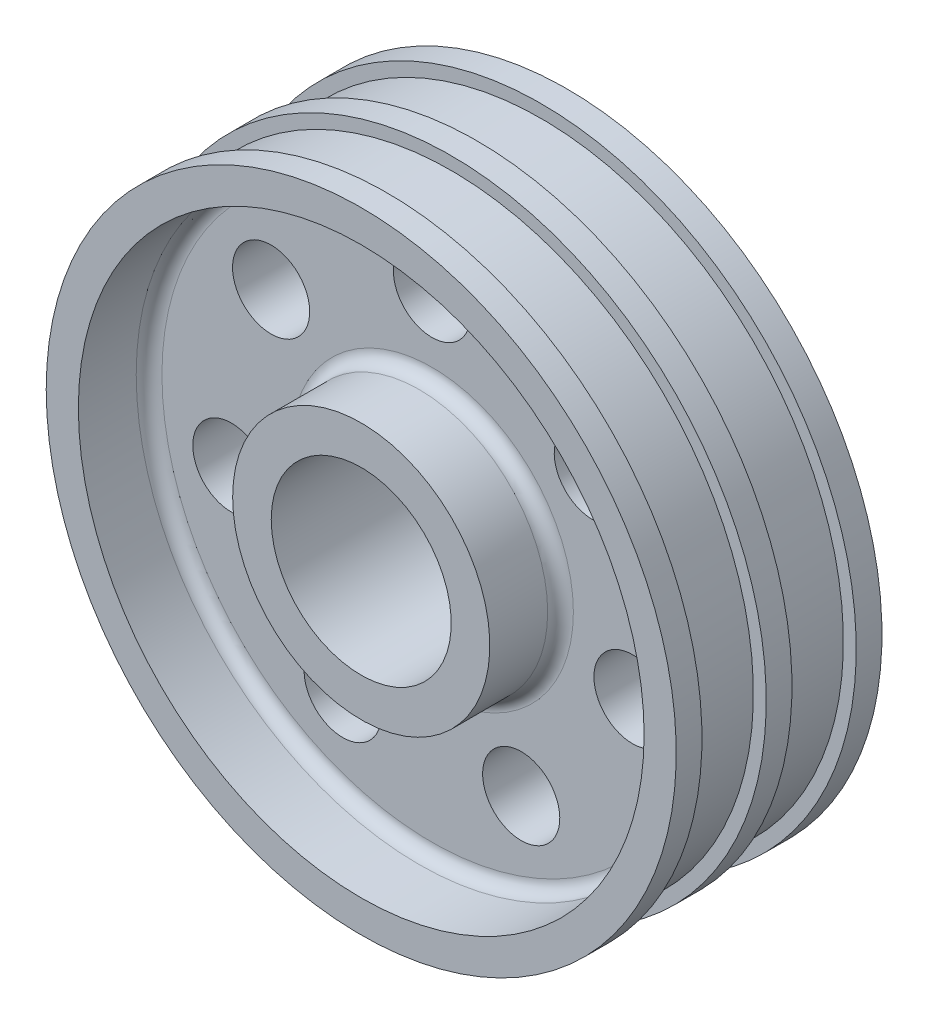
ISO-10303-21;
HEADER;
FILE_DESCRIPTION(('STEP AP214'),'2;1');
FILE_NAME('part.step','',(''),(''),'','','');
FILE_SCHEMA(('AUTOMOTIVE_DESIGN { 1 0 10303 214 1 1 1 1 }'));
ENDSEC;
DATA;
#1=APPLICATION_CONTEXT('core data for automotive mechanical design processes');
#2=APPLICATION_PROTOCOL_DEFINITION('international standard','automotive_design',2000,#1);
#3=PRODUCT_CONTEXT('',#1,'mechanical');
#4=PRODUCT('Part','Part','',(#3));
#5=PRODUCT_RELATED_PRODUCT_CATEGORY('part','',(#4));
#6=PRODUCT_DEFINITION_FORMATION('','',#4);
#7=PRODUCT_DEFINITION_CONTEXT('part definition',#1,'design');
#8=PRODUCT_DEFINITION('design','',#6,#7);
#9=PRODUCT_DEFINITION_SHAPE('','',#8);
#10=(LENGTH_UNIT() NAMED_UNIT(*) SI_UNIT(.MILLI.,.METRE.));
#11=(NAMED_UNIT(*) PLANE_ANGLE_UNIT() SI_UNIT($,.RADIAN.));
#12=(NAMED_UNIT(*) SI_UNIT($,.STERADIAN.) SOLID_ANGLE_UNIT());
#13=UNCERTAINTY_MEASURE_WITH_UNIT(LENGTH_MEASURE(1.E-05),#10,'distance_accuracy_value','');
#14=(GEOMETRIC_REPRESENTATION_CONTEXT(3) GLOBAL_UNCERTAINTY_ASSIGNED_CONTEXT((#13)) GLOBAL_UNIT_ASSIGNED_CONTEXT((#10,
#11,#12)) REPRESENTATION_CONTEXT('',''));
#15=CARTESIAN_POINT('',(0.,0.,0.));
#16=DIRECTION('',(0.,0.,1.));
#17=DIRECTION('',(1.,0.,0.));
#18=AXIS2_PLACEMENT_3D('',#15,#16,#17);
#19=CARTESIAN_POINT('',(0.,49.,16.));
#20=DIRECTION('',(0.,0.,1.));
#21=DIRECTION('',(1.,0.,0.));
#22=AXIS2_PLACEMENT_3D('',#19,#20,#21);
#23=PLANE('',#22);
#24=CARTESIAN_POINT('',(0.,0.,16.));
#25=DIRECTION('',(0.,0.,-1.));
#26=DIRECTION('',(-1.,0.,0.));
#27=AXIS2_PLACEMENT_3D('',#24,#25,#26);
#28=CIRCLE('',#27,44.);
#29=CARTESIAN_POINT('',(-44.,0.,16.));
#30=VERTEX_POINT('',#29);
#31=EDGE_CURVE('E46',#30,#30,#28,.T.);
#32=ORIENTED_EDGE('',*,*,#31,.T.);
#33=EDGE_LOOP('',(#32));
#34=FACE_BOUND('',#33,.T.);
#35=CARTESIAN_POINT('',(0.,0.,16.));
#36=DIRECTION('',(0.,0.,-1.));
#37=DIRECTION('',(-1.,0.,0.));
#38=AXIS2_PLACEMENT_3D('',#35,#36,#37);
#39=CIRCLE('',#38,49.);
#40=CARTESIAN_POINT('',(-49.,0.,16.));
#41=VERTEX_POINT('',#40);
#42=EDGE_CURVE('E75',#41,#41,#39,.T.);
#43=ORIENTED_EDGE('',*,*,#42,.F.);
#44=EDGE_LOOP('',(#43));
#45=FACE_BOUND('',#44,.T.);
#46=ADVANCED_FACE('F14',(#34,#45),#23,.T.);
#47=CARTESIAN_POINT('',(0.,0.,0.));
#48=DIRECTION('',(0.,0.,-1.));
#49=DIRECTION('',(-1.,0.,0.));
#50=AXIS2_PLACEMENT_3D('',#47,#48,#49);
#51=CYLINDRICAL_SURFACE('',#50,44.);
#52=CARTESIAN_POINT('',(0.,0.,7.));
#53=DIRECTION('',(0.,0.,1.));
#54=DIRECTION('',(1.,0.,0.));
#55=AXIS2_PLACEMENT_3D('',#52,#53,#54);
#56=CIRCLE('',#55,44.);
#57=CARTESIAN_POINT('',(44.,0.,7.));
#58=VERTEX_POINT('',#57);
#59=EDGE_CURVE('E9',#58,#58,#56,.F.);
#60=ORIENTED_EDGE('',*,*,#59,.T.);
#61=EDGE_LOOP('',(#60));
#62=FACE_BOUND('',#61,.T.);
#63=ORIENTED_EDGE('',*,*,#31,.F.);
#64=EDGE_LOOP('',(#63));
#65=FACE_BOUND('',#64,.T.);
#66=ADVANCED_FACE('F143',(#62,#65),#51,.F.);
#67=CARTESIAN_POINT('',(0.,44.,5.));
#68=DIRECTION('',(0.,0.,1.));
#69=DIRECTION('',(1.,0.,0.));
#70=AXIS2_PLACEMENT_3D('',#67,#68,#69);
#71=PLANE('',#70);
#72=CARTESIAN_POINT('',(0.,0.,5.));
#73=DIRECTION('',(0.,0.,1.));
#74=DIRECTION('',(1.,0.,0.));
#75=AXIS2_PLACEMENT_3D('',#72,#73,#74);
#76=CIRCLE('',#75,22.);
#77=CARTESIAN_POINT('',(22.,0.,5.));
#78=VERTEX_POINT('',#77);
#79=EDGE_CURVE('E40',#78,#78,#76,.F.);
#80=ORIENTED_EDGE('',*,*,#79,.T.);
#81=EDGE_LOOP('',(#80));
#82=FACE_BOUND('',#81,.T.);
#83=CARTESIAN_POINT('',(0.,0.,5.));
#84=DIRECTION('',(0.,0.,1.));
#85=DIRECTION('',(1.,0.,0.));
#86=AXIS2_PLACEMENT_3D('',#83,#84,#85);
#87=CIRCLE('',#86,42.);
#88=CARTESIAN_POINT('',(42.,0.,5.));
#89=VERTEX_POINT('',#88);
#90=EDGE_CURVE('E43',#89,#89,#87,.T.);
#91=ORIENTED_EDGE('',*,*,#90,.T.);
#92=EDGE_LOOP('',(#91));
#93=FACE_BOUND('',#92,.T.);
#94=CARTESIAN_POINT('',(-25.0186074389767,19.9516736594798,5.));
#95=DIRECTION('',(0.,0.,1.));
#96=DIRECTION('',(0.623489801858743,0.781831482468022,0.));
#97=AXIS2_PLACEMENT_3D('',#94,#95,#96);
#98=CIRCLE('',#97,6.);
#99=CARTESIAN_POINT('',(-21.2776686278242,24.6426625542879,5.));
#100=VERTEX_POINT('',#99);
#101=EDGE_CURVE('E51',#100,#100,#98,.T.);
#102=ORIENTED_EDGE('',*,*,#101,.F.);
#103=EDGE_LOOP('',(#102));
#104=FACE_BOUND('',#103,.T.);
#105=CARTESIAN_POINT('',(-31.1976931898185,-7.12066988660176,5.));
#106=DIRECTION('',(0.,0.,1.));
#107=DIRECTION('',(-0.222520933956305,0.974927912181826,0.));
#108=AXIS2_PLACEMENT_3D('',#105,#106,#107);
#109=CIRCLE('',#108,6.);
#110=CARTESIAN_POINT('',(-32.5328187935563,-1.2711024135108,5.));
#111=VERTEX_POINT('',#110);
#112=EDGE_CURVE('E50',#111,#111,#109,.T.);
#113=ORIENTED_EDGE('',*,*,#112,.F.);
#114=EDGE_LOOP('',(#113));
#115=FACE_BOUND('',#114,.T.);
#116=CARTESIAN_POINT('',(-13.8842796517621,-28.8310037728773,5.));
#117=DIRECTION('',(0.,0.,1.));
#118=DIRECTION('',(-0.900968867902416,0.433883739117565,0.));
#119=AXIS2_PLACEMENT_3D('',#116,#117,#118);
#120=CIRCLE('',#119,6.);
#121=CARTESIAN_POINT('',(-19.2900928591766,-26.2277013381719,5.));
#122=VERTEX_POINT('',#121);
#123=EDGE_CURVE('E55',#122,#122,#120,.T.);
#124=ORIENTED_EDGE('',*,*,#123,.F.);
#125=EDGE_LOOP('',(#124));
#126=FACE_BOUND('',#125,.T.);
#127=CARTESIAN_POINT('',(13.8842796517617,-28.8310037728775,5.));
#128=DIRECTION('',(0.,0.,1.));
#129=DIRECTION('',(-0.900968867902422,-0.433883739117553,0.));
#130=AXIS2_PLACEMENT_3D('',#127,#128,#129);
#131=CIRCLE('',#130,6.);
#132=CARTESIAN_POINT('',(8.47846644434717,-31.4343062075828,5.));
#133=VERTEX_POINT('',#132);
#134=EDGE_CURVE('E59',#133,#133,#131,.T.);
#135=ORIENTED_EDGE('',*,*,#134,.F.);
#136=EDGE_LOOP('',(#135));
#137=FACE_BOUND('',#136,.T.);
#138=CARTESIAN_POINT('',(31.1976931898184,-7.12066988660218,5.));
#139=DIRECTION('',(0.,0.,1.));
#140=DIRECTION('',(-0.222520933956318,-0.974927912181823,0.));
#141=AXIS2_PLACEMENT_3D('',#138,#139,#140);
#142=CIRCLE('',#141,6.);
#143=CARTESIAN_POINT('',(29.8625675860804,-12.9702373596931,5.));
#144=VERTEX_POINT('',#143);
#145=EDGE_CURVE('E63',#144,#144,#142,.T.);
#146=ORIENTED_EDGE('',*,*,#145,.F.);
#147=EDGE_LOOP('',(#146));
#148=FACE_BOUND('',#147,.T.);
#149=CARTESIAN_POINT('',(25.018607438977,19.9516736594795,5.));
#150=DIRECTION('',(0.,0.,1.));
#151=DIRECTION('',(0.623489801858732,-0.781831482468031,0.));
#152=AXIS2_PLACEMENT_3D('',#149,#150,#151);
#153=CIRCLE('',#152,6.);
#154=CARTESIAN_POINT('',(28.7595462501294,15.2606847646713,5.));
#155=VERTEX_POINT('',#154);
#156=EDGE_CURVE('E67',#155,#155,#153,.T.);
#157=ORIENTED_EDGE('',*,*,#156,.F.);
#158=EDGE_LOOP('',(#157));
#159=FACE_BOUND('',#158,.T.);
#160=CARTESIAN_POINT('',(0.,32.,5.));
#161=DIRECTION('',(0.,0.,1.));
#162=DIRECTION('',(1.,0.,0.));
#163=AXIS2_PLACEMENT_3D('',#160,#161,#162);
#164=CIRCLE('',#163,6.);
#165=CARTESIAN_POINT('',(6.,32.,5.));
#166=VERTEX_POINT('',#165);
#167=EDGE_CURVE('E71',#166,#166,#164,.T.);
#168=ORIENTED_EDGE('',*,*,#167,.F.);
#169=EDGE_LOOP('',(#168));
#170=FACE_BOUND('',#169,.T.);
#171=ADVANCED_FACE('F139',(#82,#93,#104,#115,#126,#137,#148,#159,#170),#71,.T.);
#172=CARTESIAN_POINT('',(0.,0.,0.));
#173=DIRECTION('',(0.,0.,-1.));
#174=DIRECTION('',(-1.,0.,0.));
#175=AXIS2_PLACEMENT_3D('',#172,#173,#174);
#176=CYLINDRICAL_SURFACE('',#175,20.);
#177=CARTESIAN_POINT('',(0.,0.,7.));
#178=DIRECTION('',(0.,0.,1.));
#179=DIRECTION('',(1.,0.,0.));
#180=AXIS2_PLACEMENT_3D('',#177,#178,#179);
#181=CIRCLE('',#180,20.);
#182=CARTESIAN_POINT('',(20.,0.,7.));
#183=VERTEX_POINT('',#182);
#184=EDGE_CURVE('E37',#183,#183,#181,.T.);
#185=ORIENTED_EDGE('',*,*,#184,.T.);
#186=EDGE_LOOP('',(#185));
#187=FACE_BOUND('',#186,.T.);
#188=CARTESIAN_POINT('',(0.,0.,16.));
#189=DIRECTION('',(0.,0.,-1.));
#190=DIRECTION('',(-1.,0.,0.));
#191=AXIS2_PLACEMENT_3D('',#188,#189,#190);
#192=CIRCLE('',#191,20.);
#193=CARTESIAN_POINT('',(-20.,0.,16.));
#194=VERTEX_POINT('',#193);
#195=EDGE_CURVE('E78',#194,#194,#192,.T.);
#196=ORIENTED_EDGE('',*,*,#195,.T.);
#197=EDGE_LOOP('',(#196));
#198=FACE_BOUND('',#197,.T.);
#199=ADVANCED_FACE('F142',(#187,#198),#176,.T.);
#200=CARTESIAN_POINT('',(0.,20.,16.));
#201=DIRECTION('',(0.,0.,1.));
#202=DIRECTION('',(1.,0.,0.));
#203=AXIS2_PLACEMENT_3D('',#200,#201,#202);
#204=PLANE('',#203);
#205=CARTESIAN_POINT('',(0.,0.,16.));
#206=DIRECTION('',(0.,0.,-1.));
#207=DIRECTION('',(-1.,0.,0.));
#208=AXIS2_PLACEMENT_3D('',#205,#206,#207);
#209=CIRCLE('',#208,14.);
#210=CARTESIAN_POINT('',(-14.,0.,16.));
#211=VERTEX_POINT('',#210);
#212=EDGE_CURVE('E81',#211,#211,#209,.T.);
#213=ORIENTED_EDGE('',*,*,#212,.T.);
#214=EDGE_LOOP('',(#213));
#215=FACE_BOUND('',#214,.T.);
#216=ORIENTED_EDGE('',*,*,#195,.F.);
#217=EDGE_LOOP('',(#216));
#218=FACE_BOUND('',#217,.T.);
#219=ADVANCED_FACE('F309',(#215,#218),#204,.T.);
#220=CARTESIAN_POINT('',(0.,0.,0.));
#221=DIRECTION('',(0.,0.,-1.));
#222=DIRECTION('',(-1.,0.,0.));
#223=AXIS2_PLACEMENT_3D('',#220,#221,#222);
#224=CYLINDRICAL_SURFACE('',#223,14.);
#225=CARTESIAN_POINT('',(0.,0.,-16.));
#226=DIRECTION('',(0.,0.,-1.));
#227=DIRECTION('',(-1.,0.,0.));
#228=AXIS2_PLACEMENT_3D('',#225,#226,#227);
#229=CIRCLE('',#228,14.);
#230=CARTESIAN_POINT('',(-14.,0.,-16.));
#231=VERTEX_POINT('',#230);
#232=EDGE_CURVE('E84',#231,#231,#229,.T.);
#233=ORIENTED_EDGE('',*,*,#232,.T.);
#234=EDGE_LOOP('',(#233));
#235=FACE_BOUND('',#234,.T.);
#236=ORIENTED_EDGE('',*,*,#212,.F.);
#237=EDGE_LOOP('',(#236));
#238=FACE_BOUND('',#237,.T.);
#239=ADVANCED_FACE('F403',(#235,#238),#224,.F.);
#240=CARTESIAN_POINT('',(0.,20.,-16.));
#241=DIRECTION('',(0.,0.,-1.));
#242=DIRECTION('',(-1.,0.,0.));
#243=AXIS2_PLACEMENT_3D('',#240,#241,#242);
#244=PLANE('',#243);
#245=CARTESIAN_POINT('',(0.,0.,-16.));
#246=DIRECTION('',(0.,0.,-1.));
#247=DIRECTION('',(-1.,0.,0.));
#248=AXIS2_PLACEMENT_3D('',#245,#246,#247);
#249=CIRCLE('',#248,20.);
#250=CARTESIAN_POINT('',(-20.,0.,-16.));
#251=VERTEX_POINT('',#250);
#252=EDGE_CURVE('E87',#251,#251,#249,.T.);
#253=ORIENTED_EDGE('',*,*,#252,.T.);
#254=EDGE_LOOP('',(#253));
#255=FACE_BOUND('',#254,.T.);
#256=ORIENTED_EDGE('',*,*,#232,.F.);
#257=EDGE_LOOP('',(#256));
#258=FACE_BOUND('',#257,.T.);
#259=ADVANCED_FACE('F318',(#255,#258),#244,.T.);
#260=CARTESIAN_POINT('',(0.,0.,0.));
#261=DIRECTION('',(0.,0.,-1.));
#262=DIRECTION('',(-1.,0.,0.));
#263=AXIS2_PLACEMENT_3D('',#260,#261,#262);
#264=CYLINDRICAL_SURFACE('',#263,20.);
#265=CARTESIAN_POINT('',(0.,0.,-7.));
#266=DIRECTION('',(0.,0.,-1.));
#267=DIRECTION('',(-1.,0.,0.));
#268=AXIS2_PLACEMENT_3D('',#265,#266,#267);
#269=CIRCLE('',#268,20.);
#270=CARTESIAN_POINT('',(-20.,0.,-7.));
#271=VERTEX_POINT('',#270);
#272=EDGE_CURVE('E34',#271,#271,#269,.T.);
#273=ORIENTED_EDGE('',*,*,#272,.T.);
#274=EDGE_LOOP('',(#273));
#275=FACE_BOUND('',#274,.T.);
#276=ORIENTED_EDGE('',*,*,#252,.F.);
#277=EDGE_LOOP('',(#276));
#278=FACE_BOUND('',#277,.T.);
#279=ADVANCED_FACE('F208',(#275,#278),#264,.T.);
#280=CARTESIAN_POINT('',(0.,44.,-5.));
#281=DIRECTION('',(0.,0.,-1.));
#282=DIRECTION('',(-1.,0.,0.));
#283=AXIS2_PLACEMENT_3D('',#280,#281,#282);
#284=PLANE('',#283);
#285=CARTESIAN_POINT('',(0.,0.,-5.));
#286=DIRECTION('',(0.,0.,-1.));
#287=DIRECTION('',(-1.,0.,0.));
#288=AXIS2_PLACEMENT_3D('',#285,#286,#287);
#289=CIRCLE('',#288,22.);
#290=CARTESIAN_POINT('',(-22.,0.,-5.));
#291=VERTEX_POINT('',#290);
#292=EDGE_CURVE('E25',#291,#291,#289,.F.);
#293=ORIENTED_EDGE('',*,*,#292,.T.);
#294=EDGE_LOOP('',(#293));
#295=FACE_BOUND('',#294,.T.);
#296=CARTESIAN_POINT('',(0.,0.,-5.));
#297=DIRECTION('',(0.,0.,-1.));
#298=DIRECTION('',(-1.,0.,0.));
#299=AXIS2_PLACEMENT_3D('',#296,#297,#298);
#300=CIRCLE('',#299,42.);
#301=CARTESIAN_POINT('',(-42.,0.,-5.));
#302=VERTEX_POINT('',#301);
#303=EDGE_CURVE('E29',#302,#302,#300,.T.);
#304=ORIENTED_EDGE('',*,*,#303,.T.);
#305=EDGE_LOOP('',(#304));
#306=FACE_BOUND('',#305,.T.);
#307=CARTESIAN_POINT('',(-25.0186074389767,19.9516736594798,-5.));
#308=DIRECTION('',(0.,0.,-1.));
#309=DIRECTION('',(-1.,0.,0.));
#310=AXIS2_PLACEMENT_3D('',#307,#308,#309);
#311=CIRCLE('',#310,6.);
#312=CARTESIAN_POINT('',(-31.0186074389767,19.9516736594798,-5.));
#313=VERTEX_POINT('',#312);
#314=EDGE_CURVE('E47',#313,#313,#311,.T.);
#315=ORIENTED_EDGE('',*,*,#314,.F.);
#316=EDGE_LOOP('',(#315));
#317=FACE_BOUND('',#316,.T.);
#318=CARTESIAN_POINT('',(-31.1976931898185,-7.12066988660176,-5.));
#319=DIRECTION('',(0.,0.,-1.));
#320=DIRECTION('',(-1.,0.,0.));
#321=AXIS2_PLACEMENT_3D('',#318,#319,#320);
#322=CIRCLE('',#321,6.);
#323=CARTESIAN_POINT('',(-37.1976931898185,-7.12066988660176,-5.));
#324=VERTEX_POINT('',#323);
#325=EDGE_CURVE('E52',#324,#324,#322,.T.);
#326=ORIENTED_EDGE('',*,*,#325,.F.);
#327=EDGE_LOOP('',(#326));
#328=FACE_BOUND('',#327,.T.);
#329=CARTESIAN_POINT('',(-13.8842796517621,-28.8310037728773,-5.));
#330=DIRECTION('',(0.,0.,-1.));
#331=DIRECTION('',(-1.,0.,0.));
#332=AXIS2_PLACEMENT_3D('',#329,#330,#331);
#333=CIRCLE('',#332,6.);
#334=CARTESIAN_POINT('',(-19.8842796517621,-28.8310037728773,-5.));
#335=VERTEX_POINT('',#334);
#336=EDGE_CURVE('E56',#335,#335,#333,.T.);
#337=ORIENTED_EDGE('',*,*,#336,.F.);
#338=EDGE_LOOP('',(#337));
#339=FACE_BOUND('',#338,.T.);
#340=CARTESIAN_POINT('',(13.8842796517617,-28.8310037728775,-5.));
#341=DIRECTION('',(0.,0.,-1.));
#342=DIRECTION('',(-1.,0.,0.));
#343=AXIS2_PLACEMENT_3D('',#340,#341,#342);
#344=CIRCLE('',#343,6.);
#345=CARTESIAN_POINT('',(7.8842796517617,-28.8310037728775,-5.));
#346=VERTEX_POINT('',#345);
#347=EDGE_CURVE('E60',#346,#346,#344,.T.);
#348=ORIENTED_EDGE('',*,*,#347,.F.);
#349=EDGE_LOOP('',(#348));
#350=FACE_BOUND('',#349,.T.);
#351=CARTESIAN_POINT('',(31.1976931898184,-7.12066988660218,-5.));
#352=DIRECTION('',(0.,0.,-1.));
#353=DIRECTION('',(-1.,0.,0.));
#354=AXIS2_PLACEMENT_3D('',#351,#352,#353);
#355=CIRCLE('',#354,6.);
#356=CARTESIAN_POINT('',(25.1976931898183,-7.12066988660218,-5.));
#357=VERTEX_POINT('',#356);
#358=EDGE_CURVE('E64',#357,#357,#355,.T.);
#359=ORIENTED_EDGE('',*,*,#358,.F.);
#360=EDGE_LOOP('',(#359));
#361=FACE_BOUND('',#360,.T.);
#362=CARTESIAN_POINT('',(25.018607438977,19.9516736594795,-5.));
#363=DIRECTION('',(0.,0.,-1.));
#364=DIRECTION('',(-1.,0.,0.));
#365=AXIS2_PLACEMENT_3D('',#362,#363,#364);
#366=CIRCLE('',#365,6.);
#367=CARTESIAN_POINT('',(19.018607438977,19.9516736594795,-5.));
#368=VERTEX_POINT('',#367);
#369=EDGE_CURVE('E68',#368,#368,#366,.T.);
#370=ORIENTED_EDGE('',*,*,#369,.F.);
#371=EDGE_LOOP('',(#370));
#372=FACE_BOUND('',#371,.T.);
#373=CARTESIAN_POINT('',(0.,32.,-5.));
#374=DIRECTION('',(0.,0.,-1.));
#375=DIRECTION('',(-1.,0.,0.));
#376=AXIS2_PLACEMENT_3D('',#373,#374,#375);
#377=CIRCLE('',#376,6.);
#378=CARTESIAN_POINT('',(-6.,32.,-5.));
#379=VERTEX_POINT('',#378);
#380=EDGE_CURVE('E72',#379,#379,#377,.T.);
#381=ORIENTED_EDGE('',*,*,#380,.F.);
#382=EDGE_LOOP('',(#381));
#383=FACE_BOUND('',#382,.T.);
#384=ADVANCED_FACE('F204',(#295,#306,#317,#328,#339,#350,#361,#372,#383),#284,.T.);
#385=CARTESIAN_POINT('',(0.,0.,0.));
#386=DIRECTION('',(0.,0.,-1.));
#387=DIRECTION('',(-1.,0.,0.));
#388=AXIS2_PLACEMENT_3D('',#385,#386,#387);
#389=CYLINDRICAL_SURFACE('',#388,44.);
#390=CARTESIAN_POINT('',(0.,0.,-7.));
#391=DIRECTION('',(0.,0.,-1.));
#392=DIRECTION('',(-1.,0.,0.));
#393=AXIS2_PLACEMENT_3D('',#390,#391,#392);
#394=CIRCLE('',#393,44.);
#395=CARTESIAN_POINT('',(-44.,0.,-7.));
#396=VERTEX_POINT('',#395);
#397=EDGE_CURVE('E21',#396,#396,#394,.F.);
#398=ORIENTED_EDGE('',*,*,#397,.T.);
#399=EDGE_LOOP('',(#398));
#400=FACE_BOUND('',#399,.T.);
#401=CARTESIAN_POINT('',(0.,0.,-16.));
#402=DIRECTION('',(0.,0.,-1.));
#403=DIRECTION('',(-1.,0.,0.));
#404=AXIS2_PLACEMENT_3D('',#401,#402,#403);
#405=CIRCLE('',#404,44.);
#406=CARTESIAN_POINT('',(-44.,0.,-16.));
#407=VERTEX_POINT('',#406);
#408=EDGE_CURVE('E90',#407,#407,#405,.T.);
#409=ORIENTED_EDGE('',*,*,#408,.T.);
#410=EDGE_LOOP('',(#409));
#411=FACE_BOUND('',#410,.T.);
#412=ADVANCED_FACE('F207',(#400,#411),#389,.F.);
#413=CARTESIAN_POINT('',(0.,49.,-16.));
#414=DIRECTION('',(0.,0.,-1.));
#415=DIRECTION('',(-1.,0.,0.));
#416=AXIS2_PLACEMENT_3D('',#413,#414,#415);
#417=PLANE('',#416);
#418=CARTESIAN_POINT('',(0.,0.,-16.));
#419=DIRECTION('',(0.,0.,-1.));
#420=DIRECTION('',(-1.,0.,0.));
#421=AXIS2_PLACEMENT_3D('',#418,#419,#420);
#422=CIRCLE('',#421,49.);
#423=CARTESIAN_POINT('',(-49.,0.,-16.));
#424=VERTEX_POINT('',#423);
#425=EDGE_CURVE('E93',#424,#424,#422,.T.);
#426=ORIENTED_EDGE('',*,*,#425,.T.);
#427=EDGE_LOOP('',(#426));
#428=FACE_BOUND('',#427,.T.);
#429=ORIENTED_EDGE('',*,*,#408,.F.);
#430=EDGE_LOOP('',(#429));
#431=FACE_BOUND('',#430,.T.);
#432=ADVANCED_FACE('F326',(#428,#431),#417,.T.);
#433=CARTESIAN_POINT('',(0.,0.,0.));
#434=DIRECTION('',(0.,0.,-1.));
#435=DIRECTION('',(-1.,0.,0.));
#436=AXIS2_PLACEMENT_3D('',#433,#434,#435);
#437=CYLINDRICAL_SURFACE('',#436,49.);
#438=CARTESIAN_POINT('',(0.,0.,-12.));
#439=DIRECTION('',(0.,0.,-1.));
#440=DIRECTION('',(-1.,0.,0.));
#441=AXIS2_PLACEMENT_3D('',#438,#439,#440);
#442=CIRCLE('',#441,49.);
#443=CARTESIAN_POINT('',(-49.,0.,-12.));
#444=VERTEX_POINT('',#443);
#445=EDGE_CURVE('E96',#444,#444,#442,.T.);
#446=ORIENTED_EDGE('',*,*,#445,.T.);
#447=EDGE_LOOP('',(#446));
#448=FACE_BOUND('',#447,.T.);
#449=ORIENTED_EDGE('',*,*,#425,.F.);
#450=EDGE_LOOP('',(#449));
#451=FACE_BOUND('',#450,.T.);
#452=ADVANCED_FACE('F333',(#448,#451),#437,.T.);
#453=CARTESIAN_POINT('',(0.,49.,-12.));
#454=DIRECTION('',(0.,0.,1.));
#455=DIRECTION('',(1.,0.,0.));
#456=AXIS2_PLACEMENT_3D('',#453,#454,#455);
#457=PLANE('',#456);
#458=CARTESIAN_POINT('',(0.,0.,-12.));
#459=DIRECTION('',(0.,0.,-1.));
#460=DIRECTION('',(-1.,0.,0.));
#461=AXIS2_PLACEMENT_3D('',#458,#459,#460);
#462=CIRCLE('',#461,47.);
#463=CARTESIAN_POINT('',(-47.,0.,-12.));
#464=VERTEX_POINT('',#463);
#465=EDGE_CURVE('E99',#464,#464,#462,.T.);
#466=ORIENTED_EDGE('',*,*,#465,.T.);
#467=EDGE_LOOP('',(#466));
#468=FACE_BOUND('',#467,.T.);
#469=ORIENTED_EDGE('',*,*,#445,.F.);
#470=EDGE_LOOP('',(#469));
#471=FACE_BOUND('',#470,.T.);
#472=ADVANCED_FACE('F341',(#468,#471),#457,.T.);
#473=CARTESIAN_POINT('',(0.,0.,0.));
#474=DIRECTION('',(0.,0.,-1.));
#475=DIRECTION('',(-1.,0.,0.));
#476=AXIS2_PLACEMENT_3D('',#473,#474,#475);
#477=CYLINDRICAL_SURFACE('',#476,47.);
#478=CARTESIAN_POINT('',(0.,0.,-2.));
#479=DIRECTION('',(0.,0.,-1.));
#480=DIRECTION('',(-1.,0.,0.));
#481=AXIS2_PLACEMENT_3D('',#478,#479,#480);
#482=CIRCLE('',#481,47.);
#483=CARTESIAN_POINT('',(-47.,0.,-2.));
#484=VERTEX_POINT('',#483);
#485=EDGE_CURVE('E102',#484,#484,#482,.T.);
#486=ORIENTED_EDGE('',*,*,#485,.T.);
#487=EDGE_LOOP('',(#486));
#488=FACE_BOUND('',#487,.T.);
#489=ORIENTED_EDGE('',*,*,#465,.F.);
#490=EDGE_LOOP('',(#489));
#491=FACE_BOUND('',#490,.T.);
#492=ADVANCED_FACE('F349',(#488,#491),#477,.T.);
#493=CARTESIAN_POINT('',(0.,49.,-2.));
#494=DIRECTION('',(0.,0.,-1.));
#495=DIRECTION('',(-1.,0.,0.));
#496=AXIS2_PLACEMENT_3D('',#493,#494,#495);
#497=PLANE('',#496);
#498=CARTESIAN_POINT('',(0.,0.,-2.));
#499=DIRECTION('',(0.,0.,-1.));
#500=DIRECTION('',(-1.,0.,0.));
#501=AXIS2_PLACEMENT_3D('',#498,#499,#500);
#502=CIRCLE('',#501,49.);
#503=CARTESIAN_POINT('',(-49.,0.,-2.));
#504=VERTEX_POINT('',#503);
#505=EDGE_CURVE('E105',#504,#504,#502,.T.);
#506=ORIENTED_EDGE('',*,*,#505,.T.);
#507=EDGE_LOOP('',(#506));
#508=FACE_BOUND('',#507,.T.);
#509=ORIENTED_EDGE('',*,*,#485,.F.);
#510=EDGE_LOOP('',(#509));
#511=FACE_BOUND('',#510,.T.);
#512=ADVANCED_FACE('F357',(#508,#511),#497,.T.);
#513=CARTESIAN_POINT('',(0.,0.,0.));
#514=DIRECTION('',(0.,0.,-1.));
#515=DIRECTION('',(-1.,0.,0.));
#516=AXIS2_PLACEMENT_3D('',#513,#514,#515);
#517=CYLINDRICAL_SURFACE('',#516,49.);
#518=CARTESIAN_POINT('',(0.,0.,2.));
#519=DIRECTION('',(0.,0.,-1.));
#520=DIRECTION('',(-1.,0.,0.));
#521=AXIS2_PLACEMENT_3D('',#518,#519,#520);
#522=CIRCLE('',#521,49.);
#523=CARTESIAN_POINT('',(-49.,0.,2.));
#524=VERTEX_POINT('',#523);
#525=EDGE_CURVE('E108',#524,#524,#522,.T.);
#526=ORIENTED_EDGE('',*,*,#525,.T.);
#527=EDGE_LOOP('',(#526));
#528=FACE_BOUND('',#527,.T.);
#529=ORIENTED_EDGE('',*,*,#505,.F.);
#530=EDGE_LOOP('',(#529));
#531=FACE_BOUND('',#530,.T.);
#532=ADVANCED_FACE('F365',(#528,#531),#517,.T.);
#533=CARTESIAN_POINT('',(0.,49.,2.));
#534=DIRECTION('',(0.,0.,1.));
#535=DIRECTION('',(1.,0.,0.));
#536=AXIS2_PLACEMENT_3D('',#533,#534,#535);
#537=PLANE('',#536);
#538=CARTESIAN_POINT('',(0.,0.,2.));
#539=DIRECTION('',(0.,0.,-1.));
#540=DIRECTION('',(-1.,0.,0.));
#541=AXIS2_PLACEMENT_3D('',#538,#539,#540);
#542=CIRCLE('',#541,47.);
#543=CARTESIAN_POINT('',(-47.,0.,2.));
#544=VERTEX_POINT('',#543);
#545=EDGE_CURVE('E111',#544,#544,#542,.T.);
#546=ORIENTED_EDGE('',*,*,#545,.T.);
#547=EDGE_LOOP('',(#546));
#548=FACE_BOUND('',#547,.T.);
#549=ORIENTED_EDGE('',*,*,#525,.F.);
#550=EDGE_LOOP('',(#549));
#551=FACE_BOUND('',#550,.T.);
#552=ADVANCED_FACE('F373',(#548,#551),#537,.T.);
#553=CARTESIAN_POINT('',(0.,0.,0.));
#554=DIRECTION('',(0.,0.,-1.));
#555=DIRECTION('',(-1.,0.,0.));
#556=AXIS2_PLACEMENT_3D('',#553,#554,#555);
#557=CYLINDRICAL_SURFACE('',#556,47.);
#558=CARTESIAN_POINT('',(0.,0.,12.));
#559=DIRECTION('',(0.,0.,-1.));
#560=DIRECTION('',(-1.,0.,0.));
#561=AXIS2_PLACEMENT_3D('',#558,#559,#560);
#562=CIRCLE('',#561,47.);
#563=CARTESIAN_POINT('',(-47.,0.,12.));
#564=VERTEX_POINT('',#563);
#565=EDGE_CURVE('E114',#564,#564,#562,.T.);
#566=ORIENTED_EDGE('',*,*,#565,.T.);
#567=EDGE_LOOP('',(#566));
#568=FACE_BOUND('',#567,.T.);
#569=ORIENTED_EDGE('',*,*,#545,.F.);
#570=EDGE_LOOP('',(#569));
#571=FACE_BOUND('',#570,.T.);
#572=ADVANCED_FACE('F381',(#568,#571),#557,.T.);
#573=CARTESIAN_POINT('',(0.,49.,12.));
#574=DIRECTION('',(0.,0.,-1.));
#575=DIRECTION('',(-1.,0.,0.));
#576=AXIS2_PLACEMENT_3D('',#573,#574,#575);
#577=PLANE('',#576);
#578=CARTESIAN_POINT('',(0.,0.,12.));
#579=DIRECTION('',(0.,0.,-1.));
#580=DIRECTION('',(-1.,0.,0.));
#581=AXIS2_PLACEMENT_3D('',#578,#579,#580);
#582=CIRCLE('',#581,49.);
#583=CARTESIAN_POINT('',(-49.,0.,12.));
#584=VERTEX_POINT('',#583);
#585=EDGE_CURVE('E117',#584,#584,#582,.T.);
#586=ORIENTED_EDGE('',*,*,#585,.T.);
#587=EDGE_LOOP('',(#586));
#588=FACE_BOUND('',#587,.T.);
#589=ORIENTED_EDGE('',*,*,#565,.F.);
#590=EDGE_LOOP('',(#589));
#591=FACE_BOUND('',#590,.T.);
#592=ADVANCED_FACE('F173',(#588,#591),#577,.T.);
#593=CARTESIAN_POINT('',(0.,0.,0.));
#594=DIRECTION('',(0.,0.,-1.));
#595=DIRECTION('',(-1.,0.,0.));
#596=AXIS2_PLACEMENT_3D('',#593,#594,#595);
#597=CYLINDRICAL_SURFACE('',#596,49.);
#598=ORIENTED_EDGE('',*,*,#42,.T.);
#599=EDGE_LOOP('',(#598));
#600=FACE_BOUND('',#599,.T.);
#601=ORIENTED_EDGE('',*,*,#585,.F.);
#602=EDGE_LOOP('',(#601));
#603=FACE_BOUND('',#602,.T.);
#604=ADVANCED_FACE('F161',(#600,#603),#597,.T.);
#605=CARTESIAN_POINT('',(0.,32.,-16.));
#606=DIRECTION('',(0.,0.,1.));
#607=DIRECTION('',(1.,0.,0.));
#608=AXIS2_PLACEMENT_3D('',#605,#606,#607);
#609=CYLINDRICAL_SURFACE('',#608,6.);
#610=ORIENTED_EDGE('',*,*,#380,.T.);
#611=EDGE_LOOP('',(#610));
#612=FACE_BOUND('',#611,.T.);
#613=ORIENTED_EDGE('',*,*,#167,.T.);
#614=EDGE_LOOP('',(#613));
#615=FACE_BOUND('',#614,.T.);
#616=ADVANCED_FACE('F158',(#612,#615),#609,.F.);
#617=CARTESIAN_POINT('',(25.018607438977,19.9516736594795,-16.));
#618=DIRECTION('',(0.,0.,1.));
#619=DIRECTION('',(1.,0.,0.));
#620=AXIS2_PLACEMENT_3D('',#617,#618,#619);
#621=CYLINDRICAL_SURFACE('',#620,6.);
#622=ORIENTED_EDGE('',*,*,#369,.T.);
#623=EDGE_LOOP('',(#622));
#624=FACE_BOUND('',#623,.T.);
#625=ORIENTED_EDGE('',*,*,#156,.T.);
#626=EDGE_LOOP('',(#625));
#627=FACE_BOUND('',#626,.T.);
#628=ADVANCED_FACE('F160',(#624,#627),#621,.F.);
#629=CARTESIAN_POINT('',(31.1976931898184,-7.12066988660218,-16.));
#630=DIRECTION('',(0.,0.,1.));
#631=DIRECTION('',(1.,0.,0.));
#632=AXIS2_PLACEMENT_3D('',#629,#630,#631);
#633=CYLINDRICAL_SURFACE('',#632,6.);
#634=ORIENTED_EDGE('',*,*,#358,.T.);
#635=EDGE_LOOP('',(#634));
#636=FACE_BOUND('',#635,.T.);
#637=ORIENTED_EDGE('',*,*,#145,.T.);
#638=EDGE_LOOP('',(#637));
#639=FACE_BOUND('',#638,.T.);
#640=ADVANCED_FACE('F170',(#636,#639),#633,.F.);
#641=CARTESIAN_POINT('',(13.8842796517617,-28.8310037728775,-16.));
#642=DIRECTION('',(0.,0.,1.));
#643=DIRECTION('',(1.,0.,0.));
#644=AXIS2_PLACEMENT_3D('',#641,#642,#643);
#645=CYLINDRICAL_SURFACE('',#644,6.);
#646=ORIENTED_EDGE('',*,*,#347,.T.);
#647=EDGE_LOOP('',(#646));
#648=FACE_BOUND('',#647,.T.);
#649=ORIENTED_EDGE('',*,*,#134,.T.);
#650=EDGE_LOOP('',(#649));
#651=FACE_BOUND('',#650,.T.);
#652=ADVANCED_FACE('F228',(#648,#651),#645,.F.);
#653=CARTESIAN_POINT('',(-13.8842796517621,-28.8310037728773,-16.));
#654=DIRECTION('',(0.,0.,1.));
#655=DIRECTION('',(1.,0.,0.));
#656=AXIS2_PLACEMENT_3D('',#653,#654,#655);
#657=CYLINDRICAL_SURFACE('',#656,6.);
#658=ORIENTED_EDGE('',*,*,#336,.T.);
#659=EDGE_LOOP('',(#658));
#660=FACE_BOUND('',#659,.T.);
#661=ORIENTED_EDGE('',*,*,#123,.T.);
#662=EDGE_LOOP('',(#661));
#663=FACE_BOUND('',#662,.T.);
#664=ADVANCED_FACE('F234',(#660,#663),#657,.F.);
#665=CARTESIAN_POINT('',(-31.1976931898185,-7.12066988660176,-16.));
#666=DIRECTION('',(0.,0.,1.));
#667=DIRECTION('',(1.,0.,0.));
#668=AXIS2_PLACEMENT_3D('',#665,#666,#667);
#669=CYLINDRICAL_SURFACE('',#668,6.);
#670=ORIENTED_EDGE('',*,*,#325,.T.);
#671=EDGE_LOOP('',(#670));
#672=FACE_BOUND('',#671,.T.);
#673=ORIENTED_EDGE('',*,*,#112,.T.);
#674=EDGE_LOOP('',(#673));
#675=FACE_BOUND('',#674,.T.);
#676=ADVANCED_FACE('F240',(#672,#675),#669,.F.);
#677=CARTESIAN_POINT('',(-25.0186074389767,19.9516736594798,-16.));
#678=DIRECTION('',(0.,0.,1.));
#679=DIRECTION('',(1.,0.,0.));
#680=AXIS2_PLACEMENT_3D('',#677,#678,#679);
#681=CYLINDRICAL_SURFACE('',#680,6.);
#682=ORIENTED_EDGE('',*,*,#314,.T.);
#683=EDGE_LOOP('',(#682));
#684=FACE_BOUND('',#683,.T.);
#685=ORIENTED_EDGE('',*,*,#101,.T.);
#686=EDGE_LOOP('',(#685));
#687=FACE_BOUND('',#686,.T.);
#688=ADVANCED_FACE('F137',(#684,#687),#681,.F.);
#689=CARTESIAN_POINT('',(0.,0.,7.));
#690=DIRECTION('',(0.,0.,1.));
#691=DIRECTION('',(1.,0.,0.));
#692=AXIS2_PLACEMENT_3D('',#689,#690,#691);
#693=TOROIDAL_SURFACE('',#692,22.,2.);
#694=ORIENTED_EDGE('',*,*,#184,.F.);
#695=EDGE_LOOP('',(#694));
#696=FACE_BOUND('',#695,.T.);
#697=ORIENTED_EDGE('',*,*,#79,.F.);
#698=EDGE_LOOP('',(#697));
#699=FACE_BOUND('',#698,.T.);
#700=ADVANCED_FACE('F186',(#696,#699),#693,.F.);
#701=CARTESIAN_POINT('',(0.,0.,-7.));
#702=DIRECTION('',(0.,0.,-1.));
#703=DIRECTION('',(-1.,0.,0.));
#704=AXIS2_PLACEMENT_3D('',#701,#702,#703);
#705=TOROIDAL_SURFACE('',#704,22.,2.);
#706=ORIENTED_EDGE('',*,*,#292,.F.);
#707=EDGE_LOOP('',(#706));
#708=FACE_BOUND('',#707,.T.);
#709=ORIENTED_EDGE('',*,*,#272,.F.);
#710=EDGE_LOOP('',(#709));
#711=FACE_BOUND('',#710,.T.);
#712=ADVANCED_FACE('F189',(#708,#711),#705,.F.);
#713=CARTESIAN_POINT('',(0.,0.,-7.));
#714=DIRECTION('',(0.,0.,-1.));
#715=DIRECTION('',(-1.,0.,0.));
#716=AXIS2_PLACEMENT_3D('',#713,#714,#715);
#717=TOROIDAL_SURFACE('',#716,42.,2.);
#718=ORIENTED_EDGE('',*,*,#397,.F.);
#719=EDGE_LOOP('',(#718));
#720=FACE_BOUND('',#719,.T.);
#721=ORIENTED_EDGE('',*,*,#303,.F.);
#722=EDGE_LOOP('',(#721));
#723=FACE_BOUND('',#722,.T.);
#724=ADVANCED_FACE('F192',(#720,#723),#717,.F.);
#725=CARTESIAN_POINT('',(0.,0.,7.));
#726=DIRECTION('',(0.,0.,1.));
#727=DIRECTION('',(1.,0.,0.));
#728=AXIS2_PLACEMENT_3D('',#725,#726,#727);
#729=TOROIDAL_SURFACE('',#728,42.,2.);
#730=ORIENTED_EDGE('',*,*,#90,.F.);
#731=EDGE_LOOP('',(#730));
#732=FACE_BOUND('',#731,.T.);
#733=ORIENTED_EDGE('',*,*,#59,.F.);
#734=EDGE_LOOP('',(#733));
#735=FACE_BOUND('',#734,.T.);
#736=ADVANCED_FACE('F16',(#732,#735),#729,.F.);
#737=CLOSED_SHELL('',(#46,#66,#171,#199,#219,#239,#259,#279,#384,#412,#432,#452,#472,#492,#512,
#532,#552,#572,#592,#604,#616,#628,#640,#652,#664,#676,#688,#700,#712,#724,#736));
#738=MANIFOLD_SOLID_BREP('B1',#737);
#739=ADVANCED_BREP_SHAPE_REPRESENTATION('',(#18,#738),#14);
#740=SHAPE_DEFINITION_REPRESENTATION(#9,#739);
ENDSEC;
END-ISO-10303-21;
